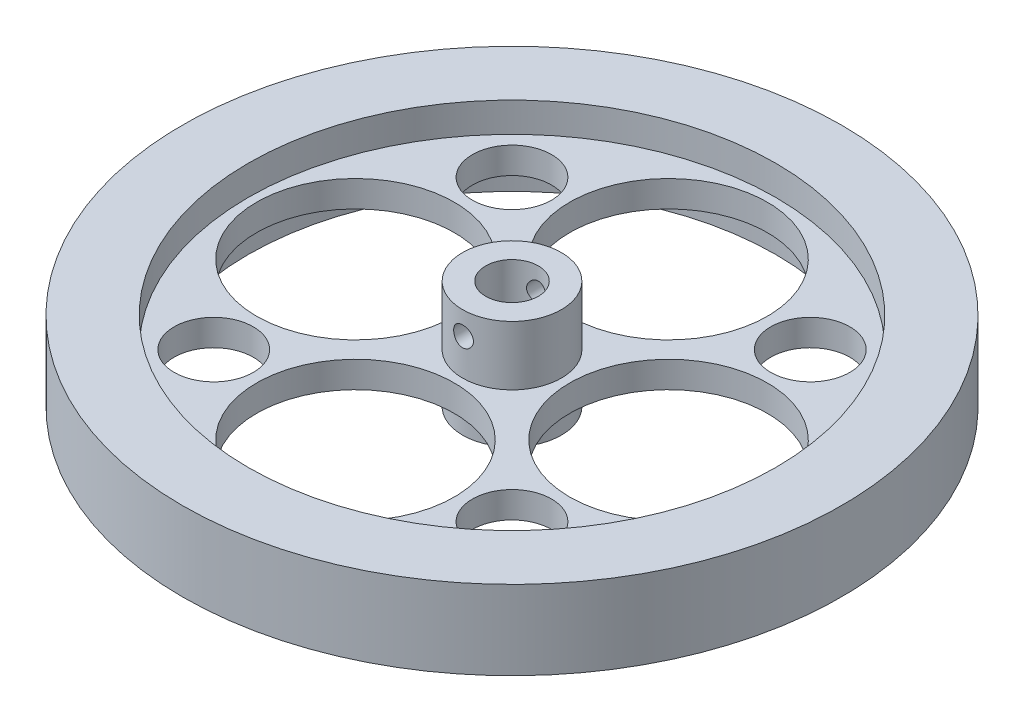
ISO-10303-21;
HEADER;
FILE_DESCRIPTION(('STEP AP214'),'2;1');
FILE_NAME('part.step','',(''),(''),'','','');
FILE_SCHEMA(('AUTOMOTIVE_DESIGN { 1 0 10303 214 1 1 1 1 }'));
ENDSEC;
DATA;
#1=APPLICATION_CONTEXT('core data for automotive mechanical design processes');
#2=APPLICATION_PROTOCOL_DEFINITION('international standard','automotive_design',2000,#1);
#3=PRODUCT_CONTEXT('',#1,'mechanical');
#4=PRODUCT('Part','Part','',(#3));
#5=PRODUCT_RELATED_PRODUCT_CATEGORY('part','',(#4));
#6=PRODUCT_DEFINITION_FORMATION('','',#4);
#7=PRODUCT_DEFINITION_CONTEXT('part definition',#1,'design');
#8=PRODUCT_DEFINITION('design','',#6,#7);
#9=PRODUCT_DEFINITION_SHAPE('','',#8);
#10=(LENGTH_UNIT() NAMED_UNIT(*) SI_UNIT(.MILLI.,.METRE.));
#11=(NAMED_UNIT(*) PLANE_ANGLE_UNIT() SI_UNIT($,.RADIAN.));
#12=(NAMED_UNIT(*) SI_UNIT($,.STERADIAN.) SOLID_ANGLE_UNIT());
#13=UNCERTAINTY_MEASURE_WITH_UNIT(LENGTH_MEASURE(1.E-05),#10,'distance_accuracy_value','');
#14=(GEOMETRIC_REPRESENTATION_CONTEXT(3) GLOBAL_UNCERTAINTY_ASSIGNED_CONTEXT((#13)) GLOBAL_UNIT_ASSIGNED_CONTEXT((#10,
#11,#12)) REPRESENTATION_CONTEXT('',''));
#15=CARTESIAN_POINT('',(0.,0.,0.));
#16=DIRECTION('',(0.,0.,1.));
#17=DIRECTION('',(1.,0.,0.));
#18=AXIS2_PLACEMENT_3D('',#15,#16,#17);
#19=CARTESIAN_POINT('',(0.,16.5,0.));
#20=DIRECTION('',(0.,-1.,0.));
#21=DIRECTION('',(0.,0.,-1.));
#22=AXIS2_PLACEMENT_3D('',#19,#20,#21);
#23=CYLINDRICAL_SURFACE('',#22,4.);
#24=CARTESIAN_POINT('',(-1.5,13.,3.70809924354783));
#25=CARTESIAN_POINT('',(-1.50000304106109,12.9189925162792,3.70809640633806));
#26=CARTESIAN_POINT('',(-1.49341597549487,12.8380050774964,3.71078260240986));
#27=CARTESIAN_POINT('',(-1.46736187895468,12.6784719170868,3.72116159304967));
#28=CARTESIAN_POINT('',(-1.44789523373263,12.599926122405,3.72885423767112));
#29=CARTESIAN_POINT('',(-1.39689657610574,12.4476246283865,3.748254802809));
#30=CARTESIAN_POINT('',(-1.36539347266348,12.3738579433489,3.7599530956926));
#31=CARTESIAN_POINT('',(-1.29131856742698,12.2326281031812,3.78603134206598));
#32=CARTESIAN_POINT('',(-1.24874344095039,12.1651668497175,3.80041210067323));
#33=CARTESIAN_POINT('',(-1.15146661374162,12.0351096883772,3.83103574665713));
#34=CARTESIAN_POINT('',(-1.09630381213306,11.9728714703706,3.84733341923603));
#35=CARTESIAN_POINT('',(-0.976395839778926,11.8582771853285,3.87949750628547));
#36=CARTESIAN_POINT('',(-0.911648630256679,11.8059232262581,3.89536382814785));
#37=CARTESIAN_POINT('',(-0.7716946551776,11.7108604877044,3.92552873936553));
#38=CARTESIAN_POINT('',(-0.696206947538027,11.6685405252841,3.93975561223505));
#39=CARTESIAN_POINT('',(-0.538555771965247,11.5973488274751,3.96438007973848));
#40=CARTESIAN_POINT('',(-0.456394630933536,11.568472428008,3.97477900217006));
#41=CARTESIAN_POINT('',(-0.291489341676832,11.5262421042254,3.9901869710344));
#42=CARTESIAN_POINT('',(-0.208923197281597,11.5122723725595,3.99540915214774));
#43=CARTESIAN_POINT('',(-0.0424643637947866,11.498278799055,4.0006401410794));
#44=CARTESIAN_POINT('',(0.0414278850628324,11.4982504223813,4.00065064414902));
#45=CARTESIAN_POINT('',(0.203743543064475,11.5117817614652,3.99559265903894));
#46=CARTESIAN_POINT('',(0.2822321782669,11.5246692979488,3.99077541996683));
#47=CARTESIAN_POINT('',(0.435839217984391,11.5625359152256,3.97693274932263));
#48=CARTESIAN_POINT('',(0.510957383430298,11.587515852262,3.96790701975578));
#49=CARTESIAN_POINT('',(0.656989017303103,11.6491704516758,3.94637769167531));
#50=CARTESIAN_POINT('',(0.727825392287308,11.6860100052684,3.93382539470077));
#51=CARTESIAN_POINT('',(0.862486607957558,11.7701920969294,3.90651310225279));
#52=CARTESIAN_POINT('',(0.926309176932322,11.8175380230176,3.8917523951284));
#53=CARTESIAN_POINT('',(1.04909048680094,11.9246272862832,3.86052529655816));
#54=CARTESIAN_POINT('',(1.10754614526348,11.9849339156504,3.84400963763883));
#55=CARTESIAN_POINT('',(1.21370395569342,12.1145929933216,3.81182460645722));
#56=CARTESIAN_POINT('',(1.261403406929,12.1839477065866,3.79615544748847));
#57=CARTESIAN_POINT('',(1.34565611808152,12.3317194674628,3.76712703500335));
#58=CARTESIAN_POINT('',(1.38193847851831,12.4103034936861,3.75382677150277));
#59=CARTESIAN_POINT('',(1.44056464441501,12.5730962251676,3.73172438629002));
#60=CARTESIAN_POINT('',(1.46291620605595,12.6573017715937,3.72291976205783));
#61=CARTESIAN_POINT('',(1.49190191709668,12.823975962316,3.71139597222848));
#62=CARTESIAN_POINT('',(1.49933521158966,12.9062841055361,3.70836785241537));
#63=CARTESIAN_POINT('',(1.50057885636272,13.0710093567417,3.70786539525016));
#64=CARTESIAN_POINT('',(1.49439261093762,13.1534264323525,3.71038967003987));
#65=CARTESIAN_POINT('',(1.46929733520157,13.3119299222877,3.72039381629735));
#66=CARTESIAN_POINT('',(1.45100618334225,13.3881311357647,3.72763276216449));
#67=CARTESIAN_POINT('',(1.40299774640638,13.5363479447202,3.74596487046362));
#68=CARTESIAN_POINT('',(1.37327812034623,13.6083626791681,3.75705882250173));
#69=CARTESIAN_POINT('',(1.30200292275278,13.7491644380762,3.7823624311608));
#70=CARTESIAN_POINT('',(1.26004545177047,13.8177292921373,3.79667328892065));
#71=CARTESIAN_POINT('',(1.16591317862479,13.947128981726,3.82662814294291));
#72=CARTESIAN_POINT('',(1.11373463696435,14.0079609746246,3.84227262594077));
#73=CARTESIAN_POINT('',(0.996727340900938,14.1241683731951,3.87433046553184));
#74=CARTESIAN_POINT('',(0.931306341491062,14.1789534087688,3.89072969357028));
#75=CARTESIAN_POINT('',(0.791797471753151,14.2768383675894,3.92149874963302));
#76=CARTESIAN_POINT('',(0.717709573322674,14.3199382529458,3.93586857107664));
#77=CARTESIAN_POINT('',(0.563016329468478,14.3929460561996,3.96094985704552));
#78=CARTESIAN_POINT('',(0.482434433064628,14.4228991237926,3.9716738133801));
#79=CARTESIAN_POINT('',(0.316881887523256,14.4686564138499,3.98829436712571));
#80=CARTESIAN_POINT('',(0.231913320723594,14.4844672854224,3.99419323299412));
#81=CARTESIAN_POINT('',(0.0653355852738171,14.5007744027548,4.00028407317073));
#82=CARTESIAN_POINT('',(-0.0161807680608437,14.502109483059,4.00078860953764));
#83=CARTESIAN_POINT('',(-0.178226786412422,14.4915848405546,3.99684889809224));
#84=CARTESIAN_POINT('',(-0.258756569245255,14.4797267091141,3.9924052471313));
#85=CARTESIAN_POINT('',(-0.414548248377124,14.4437411485064,3.97921089603771));
#86=CARTESIAN_POINT('',(-0.489890731068833,14.4199200941216,3.97056791378017));
#87=CARTESIAN_POINT('',(-0.635515473006388,14.3609899866156,3.9498778362099));
#88=CARTESIAN_POINT('',(-0.705796771275541,14.3258787966952,3.93783009655664));
#89=CARTESIAN_POINT('',(-0.842540176994411,14.2436860564952,3.91090618300074));
#90=CARTESIAN_POINT('',(-0.908717548846847,14.1961633594859,3.89593240108829));
#91=CARTESIAN_POINT('',(-1.03241734752336,14.0911921698124,3.86499507694844));
#92=CARTESIAN_POINT('',(-1.0899366712559,14.0337401341921,3.84903118274027));
#93=CARTESIAN_POINT('',(-1.19781214236196,13.9069358683549,3.81688129739175));
#94=CARTESIAN_POINT('',(-1.24762999816025,13.8371155978457,3.8007280534916));
#95=CARTESIAN_POINT('',(-1.33484709556843,13.6895841304267,3.77098325003638));
#96=CARTESIAN_POINT('',(-1.37224504878157,13.6118721159465,3.75739195631216));
#97=CARTESIAN_POINT('',(-1.4346588697426,13.4470443190246,3.73402269853266));
#98=CARTESIAN_POINT('',(-1.45906002899523,13.3596656334882,3.7244380329086));
#99=CARTESIAN_POINT('',(-1.49172356722079,13.1815147280442,3.71147994336315));
#100=CARTESIAN_POINT('',(-1.49999659339571,13.09074478729,3.70810242179736));
#101=CARTESIAN_POINT('',(-1.5,13.,3.70809924354783));
#102=B_SPLINE_CURVE_WITH_KNOTS('',3,(#24,#25,#26,#27,#28,#29,#30,#31,#32,#33,#34,#35,#36,#37,
#38,#39,#40,#41,#42,#43,#44,#45,#46,#47,#48,#49,#50,#51,#52,#53,#54,#55,#56,#57,#58,#59,#60,#61,
#62,#63,#64,#65,#66,#67,#68,#69,#70,#71,#72,#73,#74,#75,#76,#77,#78,#79,#80,#81,#82,#83,#84,#85,
#86,#87,#88,#89,#90,#91,#92,#93,#94,#95,#96,#97,#98,#99,#100,#101),.UNSPECIFIED.,.T.,.F.,(4,2,2,
2,2,2,2,2,2,2,2,2,2,2,2,2,2,2,2,2,2,2,2,2,2,2,2,2,2,2,2,2,2,2,2,2,2,2,4),(0.,0.242684541416169,
0.485361814598854,0.727459856757029,0.969630679682932,1.22274652401128,1.47591628822983,
1.73770072136421,1.9993942638133,2.24980018489679,2.50012465404857,2.73806472803194,
2.97602165263335,3.21744131210668,3.45893893628976,3.71456675065874,3.97025867827334,
4.23162592252966,4.49284751635474,4.73965657740485,4.98640395388884,5.22143845928198,
5.45652113429526,5.70041561005821,5.94439948466355,6.20385016993624,6.46330169650177,
6.72185508890168,6.98028685560126,7.22365720549935,7.46699820319479,7.7044027400389,
7.94185223512831,8.18928323676986,8.43680270894964,8.69738599542079,8.95799630544242,
9.23003178870926,9.50188762323053),.UNSPECIFIED.);
#103=CARTESIAN_POINT('',(-1.5,13.,3.70809924354783));
#104=VERTEX_POINT('',#103);
#105=EDGE_CURVE('E180',#104,#104,#102,.T.);
#106=ORIENTED_EDGE('',*,*,#105,.T.);
#107=EDGE_LOOP('',(#106));
#108=FACE_BOUND('',#107,.T.);
#109=CARTESIAN_POINT('',(0.,16.5,0.));
#110=DIRECTION('',(0.,1.,0.));
#111=DIRECTION('',(0.,0.,1.));
#112=AXIS2_PLACEMENT_3D('',#109,#110,#111);
#113=CIRCLE('',#112,4.);
#114=CARTESIAN_POINT('',(0.,16.5,4.));
#115=VERTEX_POINT('',#114);
#116=EDGE_CURVE('E250',#115,#115,#113,.T.);
#117=ORIENTED_EDGE('',*,*,#116,.T.);
#118=EDGE_LOOP('',(#117));
#119=FACE_BOUND('',#118,.T.);
#120=CARTESIAN_POINT('',(0.,0.,0.));
#121=DIRECTION('',(0.,1.,0.));
#122=DIRECTION('',(0.,0.,1.));
#123=AXIS2_PLACEMENT_3D('',#120,#121,#122);
#124=CIRCLE('',#123,4.);
#125=CARTESIAN_POINT('',(0.,0.,4.));
#126=VERTEX_POINT('',#125);
#127=EDGE_CURVE('E251',#126,#126,#124,.T.);
#128=ORIENTED_EDGE('',*,*,#127,.F.);
#129=EDGE_LOOP('',(#128));
#130=FACE_BOUND('',#129,.T.);
#131=CARTESIAN_POINT('',(0.,14.5,-4.));
#132=CARTESIAN_POINT('',(0.0812350589378528,14.5000029023031,-4.00000217456151));
#133=CARTESIAN_POINT('',(0.162450241781792,14.4933802397516,-3.99750379283184));
#134=CARTESIAN_POINT('',(0.322453452352361,14.4671718047301,-3.98778696006928));
#135=CARTESIAN_POINT('',(0.401241827987615,14.4475878995294,-3.98056918893993));
#136=CARTESIAN_POINT('',(0.554060784990879,14.3962469982282,-3.96218832391545));
#137=CARTESIAN_POINT('',(0.628100224162279,14.3645134831782,-3.9510328434944));
#138=CARTESIAN_POINT('',(0.769799310160254,14.2898935869842,-3.92588767765353));
#139=CARTESIAN_POINT('',(0.837457239177879,14.2470042144558,-3.91189723227548));
#140=CARTESIAN_POINT('',(0.967346417045825,14.1493874689291,-3.88186246971217));
#141=CARTESIAN_POINT('',(1.02927073015119,14.0942697377406,-3.86576002583566));
#142=CARTESIAN_POINT('',(1.14324421474363,13.9745895653412,-3.83360220871327));
#143=CARTESIAN_POINT('',(1.19529036359203,13.9100242439121,-3.81754685135033));
#144=CARTESIAN_POINT('',(1.28998202215985,13.7702825324768,-3.78662470617731));
#145=CARTESIAN_POINT('',(1.3321939319576,13.6947956334542,-3.77182648820818));
#146=CARTESIAN_POINT('',(1.40318646334084,13.5371516458315,-3.74599860237433));
#147=CARTESIAN_POINT('',(1.43197244961239,13.4549972368449,-3.73496742975881));
#148=CARTESIAN_POINT('',(1.47408431017549,13.2898832597418,-3.71854412824136));
#149=CARTESIAN_POINT('',(1.48799593218558,13.2070949615646,-3.71293924350838));
#150=CARTESIAN_POINT('',(1.50179556531648,13.0401838420062,-3.70738061461215));
#151=CARTESIAN_POINT('',(1.5016893680263,12.9560615861255,-3.70742453659305));
#152=CARTESIAN_POINT('',(1.48790429610018,12.794230474787,-3.71297511632055));
#153=CARTESIAN_POINT('',(1.47503808509003,12.7164390939558,-3.71815468871122));
#154=CARTESIAN_POINT('',(1.4374416786833,12.5642128495947,-3.73284938059529));
#155=CARTESIAN_POINT('',(1.41270969663258,12.4897784933861,-3.74236515298863));
#156=CARTESIAN_POINT('',(1.35163748571904,12.3447229322718,-3.76485702190253));
#157=CARTESIAN_POINT('',(1.31508648737101,12.2742005138787,-3.77789517988166));
#158=CARTESIAN_POINT('',(1.23156073762698,12.140054262409,-3.80594210139319));
#159=CARTESIAN_POINT('',(1.18458238728897,12.0764328224803,-3.82095154457158));
#160=CARTESIAN_POINT('',(1.07781780766549,11.9533963363491,-3.85248038859113));
#161=CARTESIAN_POINT('',(1.01738298716956,11.8945513592519,-3.86903347455671));
#162=CARTESIAN_POINT('',(0.887312590819022,11.7876620337942,-3.90091728164085));
#163=CARTESIAN_POINT('',(0.817675603497365,11.7396193453943,-3.91624781465952));
#164=CARTESIAN_POINT('',(0.66972343699242,11.6550696029375,-3.9442639480908));
#165=CARTESIAN_POINT('',(0.591290713844719,11.6187524187789,-3.95690498259616));
#166=CARTESIAN_POINT('',(0.428836850524583,11.56001739573,-3.97778718326962));
#167=CARTESIAN_POINT('',(0.344818210845767,11.5375933834389,-3.98603030341493));
#168=CARTESIAN_POINT('',(0.178375243148665,11.5083772124581,-3.99684443228065));
#169=CARTESIAN_POINT('',(0.0961036195622094,11.5008173936175,-3.99969369025686));
#170=CARTESIAN_POINT('',(-0.068572475255024,11.4993089361001,-4.00025893700126));
#171=CARTESIAN_POINT('',(-0.150976912983372,11.5053572796832,-3.99797606386863));
#172=CARTESIAN_POINT('',(-0.310262048561859,11.5303100423087,-3.98871709772643));
#173=CARTESIAN_POINT('',(-0.387233328007335,11.5487115437371,-3.98192470962305));
#174=CARTESIAN_POINT('',(-0.53694175495722,11.5971860725473,-3.96451477091717));
#175=CARTESIAN_POINT('',(-0.609678350347534,11.627260617948,-3.9538967228203));
#176=CARTESIAN_POINT('',(-0.751247765110155,11.6991864124395,-3.92949624407681));
#177=CARTESIAN_POINT('',(-0.819903083557796,11.7413577292234,-3.91563000209348));
#178=CARTESIAN_POINT('',(-0.949392711726626,11.8359181031716,-3.88626671564664));
#179=CARTESIAN_POINT('',(-1.01022412027045,11.8883109325452,-3.87076907009516));
#180=CARTESIAN_POINT('',(-1.12603079874454,12.0054041221243,-3.8387332949099));
#181=CARTESIAN_POINT('',(-1.18046154123569,12.0706421827727,-3.82218696503729));
#182=CARTESIAN_POINT('',(-1.27771050031903,12.2096513847077,-3.79078815746854));
#183=CARTESIAN_POINT('',(-1.32052767414518,12.2834232913885,-3.77593583194399));
#184=CARTESIAN_POINT('',(-1.39337773518998,12.4380159867723,-3.74966829822463));
#185=CARTESIAN_POINT('',(-1.42335685446918,12.5188647459104,-3.73826760328493));
#186=CARTESIAN_POINT('',(-1.46907883466889,12.6850097636878,-3.72054032891005));
#187=CARTESIAN_POINT('',(-1.48483050305535,12.7703032361981,-3.71421061057491));
#188=CARTESIAN_POINT('',(-1.50086347097839,12.9370161595411,-3.70775894792573));
#189=CARTESIAN_POINT('',(-1.50207331495837,13.0183326317169,-3.70726444523341));
#190=CARTESIAN_POINT('',(-1.49136715641593,13.1799453162762,-3.71158412745292));
#191=CARTESIAN_POINT('',(-1.47945239850124,13.2602416246716,-3.71639780898899));
#192=CARTESIAN_POINT('',(-1.44355815630242,13.4150472267166,-3.73048141585432));
#193=CARTESIAN_POINT('',(-1.41995798316524,13.4896583462453,-3.73961085376663));
#194=CARTESIAN_POINT('',(-1.3616969677992,13.6339055084944,-3.76121548297845));
#195=CARTESIAN_POINT('',(-1.32703332944945,13.7035402880701,-3.77369151995215));
#196=CARTESIAN_POINT('',(-1.24552075938154,13.8398267896976,-3.80139723903964));
#197=CARTESIAN_POINT('',(-1.1981283280301,13.9061307967999,-3.81673698440964));
#198=CARTESIAN_POINT('',(-1.09334485729906,14.0301415609712,-3.84806246757177));
#199=CARTESIAN_POINT('',(-1.03595064012808,14.0878455747868,-3.86404840943145));
#200=CARTESIAN_POINT('',(-0.909080396784623,14.1962019558218,-3.89590424609881));
#201=CARTESIAN_POINT('',(-0.839118644212993,14.2463037534347,-3.91172104900645));
#202=CARTESIAN_POINT('',(-0.691213223200821,14.3340226552766,-3.94054514457031));
#203=CARTESIAN_POINT('',(-0.613268934090621,14.3716387877364,-3.95355221851559));
#204=CARTESIAN_POINT('',(-0.447999082002311,14.4343768290483,-3.9757429260668));
#205=CARTESIAN_POINT('',(-0.360413422234207,14.4588870646019,-3.98473657158356));
#206=CARTESIAN_POINT('',(-0.181875733606381,14.4916929599207,-3.99686242179587));
#207=CARTESIAN_POINT('',(-0.0909254163648585,14.4999967514873,-3.99999756603967));
#208=CARTESIAN_POINT('',(0.,14.5,-4.));
#209=B_SPLINE_CURVE_WITH_KNOTS('',3,(#131,#132,#133,#134,#135,#136,#137,#138,#139,#140,#141,
#142,#143,#144,#145,#146,#147,#148,#149,#150,#151,#152,#153,#154,#155,#156,#157,#158,#159,#160,
#161,#162,#163,#164,#165,#166,#167,#168,#169,#170,#171,#172,#173,#174,#175,#176,#177,#178,#179,
#180,#181,#182,#183,#184,#185,#186,#187,#188,#189,#190,#191,#192,#193,#194,#195,#196,#197,#198,
#199,#200,#201,#202,#203,#204,#205,#206,#207,#208),.UNSPECIFIED.,.T.,.F.,(4,2,2,2,2,2,2,2,2,2,2,
2,2,2,2,2,2,2,2,2,2,2,2,2,2,2,2,2,2,2,2,2,2,2,2,2,2,2,4),(0.,0.243369801560559,0.48670454953046,
0.729571369213574,0.972503379609489,1.22473618582715,1.47704604925622,1.73896674501658,
2.00078269352134,2.25185874416901,2.50283106079707,2.73878345119971,2.97477138060589,
3.21522408387018,3.45575990744258,3.71246153335813,3.96920257905066,4.22991375286075,
4.49050899698846,4.73725019635925,4.9839366839052,5.2211443792384,5.45838293254453,
5.702592218596,5.94689180019868,6.20536519455658,6.46386178920141,6.72343066727204,
6.98283874956507,7.22558763480252,7.46831350211259,7.70363142426534,7.93900886656506,
8.18672471884271,8.43451941997062,8.69572329654039,8.95694749805102,9.22948515032042,
9.50188601796127),.UNSPECIFIED.);
#210=CARTESIAN_POINT('',(0.,14.5,-4.));
#211=VERTEX_POINT('',#210);
#212=EDGE_CURVE('E122',#211,#211,#209,.T.);
#213=ORIENTED_EDGE('',*,*,#212,.T.);
#214=EDGE_LOOP('',(#213));
#215=FACE_BOUND('',#214,.T.);
#216=ADVANCED_FACE('F91',(#108,#119,#130,#215),#23,.F.);
#217=CARTESIAN_POINT('',(0.,16.5,0.));
#218=DIRECTION('',(0.,-1.,0.));
#219=DIRECTION('',(0.,0.,-1.));
#220=AXIS2_PLACEMENT_3D('',#217,#218,#219);
#221=CYLINDRICAL_SURFACE('',#220,7.5);
#222=CARTESIAN_POINT('',(0.,7.5,0.));
#223=DIRECTION('',(0.,1.,0.));
#224=DIRECTION('',(0.,0.,1.));
#225=AXIS2_PLACEMENT_3D('',#222,#223,#224);
#226=CIRCLE('',#225,7.5);
#227=CARTESIAN_POINT('',(0.,7.5,7.5));
#228=VERTEX_POINT('',#227);
#229=EDGE_CURVE('E231',#228,#228,#226,.T.);
#230=ORIENTED_EDGE('',*,*,#229,.T.);
#231=EDGE_LOOP('',(#230));
#232=FACE_BOUND('',#231,.T.);
#233=CARTESIAN_POINT('',(0.,16.5,0.));
#234=DIRECTION('',(0.,1.,0.));
#235=DIRECTION('',(0.,0.,1.));
#236=AXIS2_PLACEMENT_3D('',#233,#234,#235);
#237=CIRCLE('',#236,7.5);
#238=CARTESIAN_POINT('',(0.,16.5,7.5));
#239=VERTEX_POINT('',#238);
#240=EDGE_CURVE('E245',#239,#239,#237,.T.);
#241=ORIENTED_EDGE('',*,*,#240,.F.);
#242=EDGE_LOOP('',(#241));
#243=FACE_BOUND('',#242,.T.);
#244=CARTESIAN_POINT('',(-1.5,13.,7.34846922834953));
#245=CARTESIAN_POINT('',(-1.49999691881235,12.9166534367642,7.34847088538349));
#246=CARTESIAN_POINT('',(-1.49302975757707,12.8332680650003,7.34990262402618));
#247=CARTESIAN_POINT('',(-1.46536842537441,12.668856242285,7.35546646957746));
#248=CARTESIAN_POINT('',(-1.44466327060578,12.587831733046,7.35960073717297));
#249=CARTESIAN_POINT('',(-1.39019367392958,12.4305440449688,7.37008310582665));
#250=CARTESIAN_POINT('',(-1.35644222122892,12.3542762177011,7.37642900431582));
#251=CARTESIAN_POINT('',(-1.27687366150577,12.2084877329545,7.39061699221019));
#252=CARTESIAN_POINT('',(-1.23105722790173,12.1389666991931,7.398458998102));
#253=CARTESIAN_POINT('',(-1.12796861348015,12.0076584942192,7.4148794954137));
#254=CARTESIAN_POINT('',(-1.07055848386998,11.945980618174,7.42346606755867));
#255=CARTESIAN_POINT('',(-0.946210183531966,11.8330636996315,7.440337084539));
#256=CARTESIAN_POINT('',(-0.879271345466976,11.7818253888742,7.44862150816248));
#257=CARTESIAN_POINT('',(-0.737042033886383,11.6908179735573,7.46404194626342));
#258=CARTESIAN_POINT('',(-0.661683851508316,11.651152729275,7.47116732162326));
#259=CARTESIAN_POINT('',(-0.505206225580908,11.5850875944278,7.48337605325447));
#260=CARTESIAN_POINT('',(-0.42408732213083,11.5586864621485,7.48845960066179));
#261=CARTESIAN_POINT('',(-0.259525159917742,11.5202392095706,7.49595481032628));
#262=CARTESIAN_POINT('',(-0.176126608822222,11.5080085336435,7.4984007943219));
#263=CARTESIAN_POINT('',(-0.008427852656305,11.4976735722425,7.50046381775405));
#264=CARTESIAN_POINT('',(0.0758722647477642,11.4995679255313,7.50008112979138));
#265=CARTESIAN_POINT('',(0.241713001115382,11.5172892703233,7.49655652302773));
#266=CARTESIAN_POINT('',(0.323275821447705,11.5329174657518,7.49345397548757));
#267=CARTESIAN_POINT('',(0.482597439870451,11.5773475486883,7.48488265739113));
#268=CARTESIAN_POINT('',(0.560356085620693,11.6061499632878,7.47941379216059));
#269=CARTESIAN_POINT('',(0.71042919480133,11.6762950602209,7.46665944029938));
#270=CARTESIAN_POINT('',(0.782706261200849,11.7177156266573,7.45936272262835));
#271=CARTESIAN_POINT('',(0.919357568789633,11.8118636158549,7.44375704210678));
#272=CARTESIAN_POINT('',(0.983730899287501,11.8645923396558,7.43544796282833));
#273=CARTESIAN_POINT('',(1.10392714658019,11.9809504331627,7.41856446546689));
#274=CARTESIAN_POINT('',(1.15958147486045,12.0447537800944,7.40998794686274));
#275=CARTESIAN_POINT('',(1.25942773976521,12.1808746636761,7.39367357398141));
#276=CARTESIAN_POINT('',(1.30361945959163,12.2531923613248,7.38593573556822));
#277=CARTESIAN_POINT('',(1.37934422220282,12.4045312477327,7.37217071209385));
#278=CARTESIAN_POINT('',(1.41084997166656,12.4835664514595,7.36614722345324));
#279=CARTESIAN_POINT('',(1.46008551244137,12.645956985586,7.35654714481909));
#280=CARTESIAN_POINT('',(1.47781709918496,12.7293117514286,7.35297023592642));
#281=CARTESIAN_POINT('',(1.49874900905408,12.8964472869986,7.34873218901742));
#282=CARTESIAN_POINT('',(1.50219278834687,12.9801963614655,7.34802220585731));
#283=CARTESIAN_POINT('',(1.49510644246611,13.1470723347995,7.34946728533281));
#284=CARTESIAN_POINT('',(1.48457710968366,13.2301992686783,7.35162218550582));
#285=CARTESIAN_POINT('',(1.45005331211124,13.3926529604384,7.35850848742372));
#286=CARTESIAN_POINT('',(1.42618893125895,13.4720085145536,7.36321498521745));
#287=CARTESIAN_POINT('',(1.36581155296278,13.6255949185431,7.37465234027497));
#288=CARTESIAN_POINT('',(1.32929751355977,13.6998253456536,7.38138336429404));
#289=CARTESIAN_POINT('',(1.2441062133234,13.8421196649252,7.39622108943059));
#290=CARTESIAN_POINT('',(1.19527661697413,13.9100905694512,7.40434457797355));
#291=CARTESIAN_POINT('',(1.08704335831907,14.0369624680014,7.42100585739955));
#292=CARTESIAN_POINT('',(1.02763860771681,14.0958625273739,7.42954369085727));
#293=CARTESIAN_POINT('',(0.898848410246836,14.2038438387784,7.44623018803823));
#294=CARTESIAN_POINT('',(0.829323748394445,14.252760481975,7.45437086563026));
#295=CARTESIAN_POINT('',(0.682901844952133,14.3382188222494,7.4692069144293));
#296=CARTESIAN_POINT('',(0.606004913150261,14.3747610390172,7.47590234632816));
#297=CARTESIAN_POINT('',(0.447454021236019,14.43419330762,7.487059410916));
#298=CARTESIAN_POINT('',(0.365830010217117,14.4571607773394,7.49153368713906));
#299=CARTESIAN_POINT('',(0.199784182019869,14.4890368714958,7.4977985390649));
#300=CARTESIAN_POINT('',(0.115362703066821,14.4979471892135,7.49958943799765));
#301=CARTESIAN_POINT('',(-0.0523093408554347,14.5013904714443,7.50027810681181));
#302=CARTESIAN_POINT('',(-0.135554718212253,14.4961709206843,7.49922567824026));
#303=CARTESIAN_POINT('',(-0.299956546973462,14.4720490741783,7.49445065340477));
#304=CARTESIAN_POINT('',(-0.381113024630536,14.4531469504779,7.49072809071528));
#305=CARTESIAN_POINT('',(-0.538879124617644,14.4023065118625,7.481032475475));
#306=CARTESIAN_POINT('',(-0.615498664860421,14.3703979328032,7.47506455871866));
#307=CARTESIAN_POINT('',(-0.762331830278929,14.2944816380037,7.46152083185077));
#308=CARTESIAN_POINT('',(-0.832544948651117,14.2504729661444,7.45394489468828));
#309=CARTESIAN_POINT('',(-0.965795835159535,14.1507709194069,7.43786398736791));
#310=CARTESIAN_POINT('',(-1.02869957417475,14.0949004954198,7.4293460013317));
#311=CARTESIAN_POINT('',(-1.14432392663527,13.9734246398563,7.41241834355477));
#312=CARTESIAN_POINT('',(-1.19704212480408,13.9078169057969,7.40400869794476));
#313=CARTESIAN_POINT('',(-1.29133832918279,13.7678810249497,7.3881501412478));
#314=CARTESIAN_POINT('',(-1.33279022195961,13.6934665582593,7.38071255446371));
#315=CARTESIAN_POINT('',(-1.40253607393175,13.5386008400506,7.36777855777287));
#316=CARTESIAN_POINT('',(-1.43084196896908,13.4581551419537,7.36228038807748));
#317=CARTESIAN_POINT('',(-1.4680037097813,13.3146063168448,7.3549452169166));
#318=CARTESIAN_POINT('',(-1.47998084778413,13.2523218707315,7.35253177367824));
#319=CARTESIAN_POINT('',(-1.49598002694097,13.1266990681708,7.34929317692711));
#320=CARTESIAN_POINT('',(-1.50000234234439,13.0633607481326,7.34846796865859));
#321=CARTESIAN_POINT('',(-1.5,13.,7.34846922834953));
#322=B_SPLINE_CURVE_WITH_KNOTS('',3,(#244,#245,#246,#247,#248,#249,#250,#251,#252,#253,#254,
#255,#256,#257,#258,#259,#260,#261,#262,#263,#264,#265,#266,#267,#268,#269,#270,#271,#272,#273,
#274,#275,#276,#277,#278,#279,#280,#281,#282,#283,#284,#285,#286,#287,#288,#289,#290,#291,#292,
#293,#294,#295,#296,#297,#298,#299,#300,#301,#302,#303,#304,#305,#306,#307,#308,#309,#310,#311,
#312,#313,#314,#315,#316,#317,#318,#319,#320,#321),.UNSPECIFIED.,.T.,.F.,(4,2,2,2,2,2,2,2,2,2,2,
2,2,2,2,2,2,2,2,2,2,2,2,2,2,2,2,2,2,2,2,2,2,2,2,2,2,2,4),(0.,0.249807695804143,
0.499815358926445,0.74957474691088,0.999320197289796,1.25223378822655,1.50516510053133,
1.76030100656175,2.0154130236984,2.26716373324621,2.51889018174372,2.76703184450306,
3.01518343610625,3.26489886333455,3.51464303655099,3.76874020143725,4.02284217184081,
4.27748794759165,4.53210052524037,4.7823563670689,5.03259801792632,5.28044012674978,
5.52830265531597,5.77939589661782,6.03051499305313,6.28548902600176,6.54045234945157,
6.79394720367975,7.04741152037442,7.29646526122029,7.54551587050135,7.79400025613177,
8.04250428202026,8.29501728038395,8.54759008334671,8.80288347868561,9.05794462633399,
9.24785705455344,9.43776293526322),.UNSPECIFIED.);
#323=CARTESIAN_POINT('',(-1.5,13.,7.34846922834953));
#324=VERTEX_POINT('',#323);
#325=EDGE_CURVE('E157',#324,#324,#322,.T.);
#326=ORIENTED_EDGE('',*,*,#325,.F.);
#327=EDGE_LOOP('',(#326));
#328=FACE_BOUND('',#327,.T.);
#329=CARTESIAN_POINT('',(0.,14.5,-7.5));
#330=CARTESIAN_POINT('',(0.0833653601889497,14.4999969332525,-7.49999846371307));
#331=CARTESIAN_POINT('',(0.166769490302283,14.4930267355485,-7.49859577767346));
#332=CARTESIAN_POINT('',(0.331220261533529,14.4653522498271,-7.49313548434847));
#333=CARTESIAN_POINT('',(0.412264976312033,14.4446370507977,-7.48907576790279));
#334=CARTESIAN_POINT('',(0.569595457894969,14.3901380895688,-7.4787547391743));
#335=CARTESIAN_POINT('',(0.645885701899701,14.356366844733,-7.47249553615077));
#336=CARTESIAN_POINT('',(0.791711983296338,14.2767516287331,-7.45845597052971));
#337=CARTESIAN_POINT('',(0.861248422613717,14.2309083765892,-7.4506756985356));
#338=CARTESIAN_POINT('',(0.992540215972297,14.1277922585629,-7.43433247994955));
#339=CARTESIAN_POINT('',(1.05419092673779,14.0703874669132,-7.42576118256521));
#340=CARTESIAN_POINT('',(1.16705513491204,13.9460613754124,-7.40886270678882));
#341=CARTESIAN_POINT('',(1.21826781715564,13.8791393329973,-7.40053554750636));
#342=CARTESIAN_POINT('',(1.30924763002143,13.7369257104822,-7.38498662718923));
#343=CARTESIAN_POINT('',(1.3489064082988,13.6615635343055,-7.37777561047419));
#344=CARTESIAN_POINT('',(1.41495849987046,13.5050772714939,-7.36539402087627));
#345=CARTESIAN_POINT('',(1.44135312365586,13.4239537549805,-7.36022324642942));
#346=CARTESIAN_POINT('',(1.47978794982724,13.2593734541381,-7.35259207878307));
#347=CARTESIAN_POINT('',(1.49201174693817,13.1759611837867,-7.35009705160781));
#348=CARTESIAN_POINT('',(1.50232819158918,13.0082352679535,-7.34799562590941));
#349=CARTESIAN_POINT('',(1.50042228407025,12.9239217155198,-7.34838893201761));
#350=CARTESIAN_POINT('',(1.48268185965273,12.7581298179685,-7.35198826722277));
#351=CARTESIAN_POINT('',(1.46705781036586,12.676627891559,-7.35515179288145));
#352=CARTESIAN_POINT('',(1.42265682693458,12.5174258850055,-7.36386819240002));
#353=CARTESIAN_POINT('',(1.39387926465102,12.4397259866215,-7.36942118036668));
#354=CARTESIAN_POINT('',(1.32378717551208,12.2897271074446,-7.38233427750612));
#355=CARTESIAN_POINT('',(1.28238922684817,12.2174681806462,-7.38970634720557));
#356=CARTESIAN_POINT('',(1.18829036185902,12.0808437250408,-7.40541928159593));
#357=CARTESIAN_POINT('',(1.13558814653524,12.0164791047233,-7.41376025757549));
#358=CARTESIAN_POINT('',(1.01924990184088,11.8962558963146,-7.43065531862193));
#359=CARTESIAN_POINT('',(0.955434241818668,11.8405711482113,-7.43921053816357));
#360=CARTESIAN_POINT('',(0.819277536093016,11.7406692305482,-7.45543273071613));
#361=CARTESIAN_POINT('',(0.746936381069084,11.6964522080596,-7.4630996923346));
#362=CARTESIAN_POINT('',(0.595589080318382,11.620708736161,-7.47670035241331));
#363=CARTESIAN_POINT('',(0.51657272937795,11.5892021595332,-7.48263133272408));
#364=CARTESIAN_POINT('',(0.354223464672997,11.5399592889421,-7.49207113481787));
#365=CARTESIAN_POINT('',(0.270891075108675,11.5222213268896,-7.49558025000797));
#366=CARTESIAN_POINT('',(0.103769108440726,11.5012653193086,-7.49974007800302));
#367=CARTESIAN_POINT('',(0.0200104924883651,11.4978093706896,-7.50043761978705));
#368=CARTESIAN_POINT('',(-0.14688740128907,11.5048747884133,-7.49902577895154));
#369=CARTESIAN_POINT('',(-0.230026713665689,11.5153953690289,-7.49691655412169));
#370=CARTESIAN_POINT('',(-0.392558489919811,11.5499175603159,-7.49015748012026));
#371=CARTESIAN_POINT('',(-0.471977922509854,11.5737971027469,-7.4855306460631));
#372=CARTESIAN_POINT('',(-0.6256854412495,11.6342259739837,-7.47425328091549));
#373=CARTESIAN_POINT('',(-0.699973142456309,11.6707762520152,-7.4676025982134));
#374=CARTESIAN_POINT('',(-0.842311760529325,11.756023735977,-7.45289867299942));
#375=CARTESIAN_POINT('',(-0.910275190128281,11.8048641715584,-7.44482925655578));
#376=CARTESIAN_POINT('',(-1.03712702867881,11.9131137868109,-7.42822102244824));
#377=CARTESIAN_POINT('',(-1.09601446339614,11.9725240995998,-7.41968215452582));
#378=CARTESIAN_POINT('',(-1.20396088616126,12.1013100278367,-7.40293955335447));
#379=CARTESIAN_POINT('',(-1.25285655367298,12.170823616332,-7.39474290349956));
#380=CARTESIAN_POINT('',(-1.33827813007681,12.317217042035,-7.37976287694291));
#381=CARTESIAN_POINT('',(-1.37480453388435,12.3940965843603,-7.37297944370014));
#382=CARTESIAN_POINT('',(-1.43422776237294,12.5526523692243,-7.36165110876574));
#383=CARTESIAN_POINT('',(-1.45719524968658,12.6343012618155,-7.3570946230828));
#384=CARTESIAN_POINT('',(-1.48906297744079,12.8004001802364,-7.35071155188038));
#385=CARTESIAN_POINT('',(-1.49796505233767,12.884849839314,-7.34888461036667));
#386=CARTESIAN_POINT('',(-1.5013813663012,13.0525132968165,-7.34818724447069));
#387=CARTESIAN_POINT('',(-1.49615368210634,13.1357217233905,-7.34926378783951));
#388=CARTESIAN_POINT('',(-1.47202845615009,13.3000474748575,-7.35413360226921));
#389=CARTESIAN_POINT('',(-1.45313102419395,13.3811648165422,-7.35792685150754));
#390=CARTESIAN_POINT('',(-1.40231785274843,13.5388415668608,-7.36777896328738));
#391=CARTESIAN_POINT('',(-1.37043376007602,13.6154115407536,-7.37383231528246));
#392=CARTESIAN_POINT('',(-1.29458196690241,13.7621555811017,-7.38752572461255));
#393=CARTESIAN_POINT('',(-1.25061325316232,13.8323291105877,-7.39516591498341));
#394=CARTESIAN_POINT('',(-1.15095887217962,13.9655733582255,-7.41133440784838));
#395=CARTESIAN_POINT('',(-1.09508683085277,14.0285031479014,-7.41987559364549));
#396=CARTESIAN_POINT('',(-0.973596553519712,14.1441793082938,-7.43679122807932));
#397=CARTESIAN_POINT('',(-0.907976080730004,14.1969233354759,-7.44516563794777));
#398=CARTESIAN_POINT('',(-0.768026443632371,14.2912519659197,-7.46090748581957));
#399=CARTESIAN_POINT('',(-0.693613326644753,14.33271400492,-7.46826346828869));
#400=CARTESIAN_POINT('',(-0.5387495414111,14.4024791838949,-7.481026876275));
#401=CARTESIAN_POINT('',(-0.458304391294691,14.4307941842987,-7.48643605707924));
#402=CARTESIAN_POINT('',(-0.31473223338567,14.4679779220671,-7.49364558893056));
#403=CARTESIAN_POINT('',(-0.252422496020677,14.4799647905616,-7.49601454737677));
#404=CARTESIAN_POINT('',(-0.1267492878151,14.4959768685375,-7.49919231209839));
#405=CARTESIAN_POINT('',(-0.0633858506229285,14.5000023317647,-7.50000116809732));
#406=CARTESIAN_POINT('',(0.,14.5,-7.5));
#407=B_SPLINE_CURVE_WITH_KNOTS('',3,(#329,#330,#331,#332,#333,#334,#335,#336,#337,#338,#339,
#340,#341,#342,#343,#344,#345,#346,#347,#348,#349,#350,#351,#352,#353,#354,#355,#356,#357,#358,
#359,#360,#361,#362,#363,#364,#365,#366,#367,#368,#369,#370,#371,#372,#373,#374,#375,#376,#377,
#378,#379,#380,#381,#382,#383,#384,#385,#386,#387,#388,#389,#390,#391,#392,#393,#394,#395,#396,
#397,#398,#399,#400,#401,#402,#403,#404,#405,#406),.UNSPECIFIED.,.T.,.F.,(4,2,2,2,2,2,2,2,2,2,2,
2,2,2,2,2,2,2,2,2,2,2,2,2,2,2,2,2,2,2,2,2,2,2,2,2,2,2,4),(0.,0.249864195991888,
0.499926976036984,0.749750602875512,0.999559353346295,1.25239900516828,1.50525839512105,
1.76041792508884,2.01555224047796,2.26734277655381,2.51910756421838,2.76707590509417,
3.01505608880594,3.26471235305389,3.51439732124505,3.76857378737026,4.0227535130973,
4.27732912281036,4.53187388547054,4.78216103514398,5.03243411486801,5.28045680926085,
5.52849808824033,5.77957599050038,6.03068082518895,6.28560942868839,6.540527830852,
6.79410571549085,7.04765052495622,7.29659583851552,7.54553915238912,7.79387941879665,
8.042240513728,8.29482114358714,8.54745981799396,8.80274245013455,9.05779433276278,
9.24778162934841,9.43776287056494),.UNSPECIFIED.);
#408=CARTESIAN_POINT('',(0.,14.5,-7.5));
#409=VERTEX_POINT('',#408);
#410=EDGE_CURVE('E95',#409,#409,#407,.T.);
#411=ORIENTED_EDGE('',*,*,#410,.F.);
#412=EDGE_LOOP('',(#411));
#413=FACE_BOUND('',#412,.T.);
#414=ADVANCED_FACE('F163',(#232,#243,#328,#413),#221,.T.);
#415=CARTESIAN_POINT('',(0.,12.,0.));
#416=DIRECTION('',(0.,-1.,0.));
#417=DIRECTION('',(0.,0.,-1.));
#418=AXIS2_PLACEMENT_3D('',#415,#416,#417);
#419=CYLINDRICAL_SURFACE('',#418,40.);
#420=CARTESIAN_POINT('',(0.,0.,0.));
#421=DIRECTION('',(0.,1.,0.));
#422=DIRECTION('',(0.,0.,1.));
#423=AXIS2_PLACEMENT_3D('',#420,#421,#422);
#424=CIRCLE('',#423,40.);
#425=CARTESIAN_POINT('',(0.,0.,40.));
#426=VERTEX_POINT('',#425);
#427=EDGE_CURVE('E225',#426,#426,#424,.T.);
#428=ORIENTED_EDGE('',*,*,#427,.F.);
#429=EDGE_LOOP('',(#428));
#430=FACE_BOUND('',#429,.T.);
#431=CARTESIAN_POINT('',(0.,3.5,0.));
#432=DIRECTION('',(0.,1.,0.));
#433=DIRECTION('',(0.,0.,1.));
#434=AXIS2_PLACEMENT_3D('',#431,#432,#433);
#435=CIRCLE('',#434,40.);
#436=CARTESIAN_POINT('',(0.,3.5,40.));
#437=VERTEX_POINT('',#436);
#438=EDGE_CURVE('E235',#437,#437,#435,.T.);
#439=ORIENTED_EDGE('',*,*,#438,.T.);
#440=EDGE_LOOP('',(#439));
#441=FACE_BOUND('',#440,.T.);
#442=ADVANCED_FACE('F217',(#430,#441),#419,.F.);
#443=CARTESIAN_POINT('',(0.,7.5,0.));
#444=DIRECTION('',(0.,1.,0.));
#445=DIRECTION('',(0.,0.,1.));
#446=AXIS2_PLACEMENT_3D('',#443,#444,#445);
#447=CIRCLE('',#446,40.);
#448=CARTESIAN_POINT('',(0.,7.5,40.));
#449=VERTEX_POINT('',#448);
#450=EDGE_CURVE('E11',#449,#449,#447,.T.);
#451=ORIENTED_EDGE('',*,*,#450,.F.);
#452=EDGE_LOOP('',(#451));
#453=FACE_BOUND('',#452,.T.);
#454=CARTESIAN_POINT('',(0.,12.,0.));
#455=DIRECTION('',(0.,1.,0.));
#456=DIRECTION('',(0.,0.,1.));
#457=AXIS2_PLACEMENT_3D('',#454,#455,#456);
#458=CIRCLE('',#457,40.);
#459=CARTESIAN_POINT('',(0.,12.,40.));
#460=VERTEX_POINT('',#459);
#461=EDGE_CURVE('E111',#460,#460,#458,.T.);
#462=ORIENTED_EDGE('',*,*,#461,.T.);
#463=EDGE_LOOP('',(#462));
#464=FACE_BOUND('',#463,.T.);
#465=ADVANCED_FACE('F93',(#453,#464),#419,.F.);
#466=CARTESIAN_POINT('',(0.,12.,0.));
#467=DIRECTION('',(0.,-1.,0.));
#468=DIRECTION('',(0.,0.,-1.));
#469=AXIS2_PLACEMENT_3D('',#466,#467,#468);
#470=CYLINDRICAL_SURFACE('',#469,50.);
#471=CARTESIAN_POINT('',(0.,12.,0.));
#472=DIRECTION('',(0.,1.,0.));
#473=DIRECTION('',(0.,0.,1.));
#474=AXIS2_PLACEMENT_3D('',#471,#472,#473);
#475=CIRCLE('',#474,50.);
#476=CARTESIAN_POINT('',(0.,12.,50.));
#477=VERTEX_POINT('',#476);
#478=EDGE_CURVE('E105',#477,#477,#475,.T.);
#479=ORIENTED_EDGE('',*,*,#478,.F.);
#480=EDGE_LOOP('',(#479));
#481=FACE_BOUND('',#480,.T.);
#482=CARTESIAN_POINT('',(0.,0.,0.));
#483=DIRECTION('',(0.,1.,0.));
#484=DIRECTION('',(0.,0.,1.));
#485=AXIS2_PLACEMENT_3D('',#482,#483,#484);
#486=CIRCLE('',#485,50.);
#487=CARTESIAN_POINT('',(0.,0.,50.));
#488=VERTEX_POINT('',#487);
#489=EDGE_CURVE('E115',#488,#488,#486,.T.);
#490=ORIENTED_EDGE('',*,*,#489,.T.);
#491=EDGE_LOOP('',(#490));
#492=FACE_BOUND('',#491,.T.);
#493=ADVANCED_FACE('F208',(#481,#492),#470,.T.);
#494=CARTESIAN_POINT('',(0.,12.,0.));
#495=DIRECTION('',(0.,1.,0.));
#496=DIRECTION('',(0.,0.,1.));
#497=AXIS2_PLACEMENT_3D('',#494,#495,#496);
#498=PLANE('',#497);
#499=ORIENTED_EDGE('',*,*,#461,.F.);
#500=EDGE_LOOP('',(#499));
#501=FACE_BOUND('',#500,.T.);
#502=ORIENTED_EDGE('',*,*,#478,.T.);
#503=EDGE_LOOP('',(#502));
#504=FACE_BOUND('',#503,.T.);
#505=ADVANCED_FACE('F205',(#501,#504),#498,.T.);
#506=CARTESIAN_POINT('',(0.,0.,0.));
#507=DIRECTION('',(0.,1.,0.));
#508=DIRECTION('',(0.,0.,1.));
#509=AXIS2_PLACEMENT_3D('',#506,#507,#508);
#510=PLANE('',#509);
#511=ORIENTED_EDGE('',*,*,#427,.T.);
#512=EDGE_LOOP('',(#511));
#513=FACE_BOUND('',#512,.T.);
#514=ORIENTED_EDGE('',*,*,#489,.F.);
#515=EDGE_LOOP('',(#514));
#516=FACE_BOUND('',#515,.T.);
#517=ADVANCED_FACE('F199',(#513,#516),#510,.F.);
#518=CARTESIAN_POINT('',(0.,7.5,0.));
#519=DIRECTION('',(0.,1.,0.));
#520=DIRECTION('',(0.,0.,1.));
#521=AXIS2_PLACEMENT_3D('',#518,#519,#520);
#522=PLANE('',#521);
#523=CARTESIAN_POINT('',(1.34130558950027E-12,7.5,23.75));
#524=DIRECTION('',(0.,1.,0.));
#525=DIRECTION('',(0.,0.,1.));
#526=AXIS2_PLACEMENT_3D('',#523,#524,#525);
#527=CIRCLE('',#526,15.0000000000014);
#528=CARTESIAN_POINT('',(1.34130558950027E-12,7.5,38.7500000000014));
#529=VERTEX_POINT('',#528);
#530=EDGE_CURVE('E156',#529,#529,#527,.T.);
#531=ORIENTED_EDGE('',*,*,#530,.F.);
#532=EDGE_LOOP('',(#531));
#533=FACE_BOUND('',#532,.T.);
#534=CARTESIAN_POINT('',(-22.6274169979682,7.5,22.6274169979695));
#535=DIRECTION('',(0.,1.,0.));
#536=DIRECTION('',(0.,0.,1.));
#537=AXIS2_PLACEMENT_3D('',#534,#535,#536);
#538=CIRCLE('',#537,6.00000000000064);
#539=CARTESIAN_POINT('',(-22.6274169979682,7.5,28.6274169979702));
#540=VERTEX_POINT('',#539);
#541=EDGE_CURVE('E152',#540,#540,#538,.T.);
#542=ORIENTED_EDGE('',*,*,#541,.F.);
#543=EDGE_LOOP('',(#542));
#544=FACE_BOUND('',#543,.T.);
#545=CARTESIAN_POINT('',(-22.6274169979696,7.5,-22.6274169979695));
#546=DIRECTION('',(0.,1.,0.));
#547=DIRECTION('',(0.,0.,1.));
#548=AXIS2_PLACEMENT_3D('',#545,#546,#547);
#549=CIRCLE('',#548,6.);
#550=CARTESIAN_POINT('',(-22.6274169979696,7.5,-16.6274169979695));
#551=VERTEX_POINT('',#550);
#552=EDGE_CURVE('E147',#551,#551,#549,.T.);
#553=ORIENTED_EDGE('',*,*,#552,.F.);
#554=EDGE_LOOP('',(#553));
#555=FACE_BOUND('',#554,.T.);
#556=CARTESIAN_POINT('',(0.,7.5,-23.75));
#557=DIRECTION('',(0.,1.,0.));
#558=DIRECTION('',(0.,0.,1.));
#559=AXIS2_PLACEMENT_3D('',#556,#557,#558);
#560=CIRCLE('',#559,15.);
#561=CARTESIAN_POINT('',(0.,7.5,-8.75));
#562=VERTEX_POINT('',#561);
#563=EDGE_CURVE('E142',#562,#562,#560,.T.);
#564=ORIENTED_EDGE('',*,*,#563,.F.);
#565=EDGE_LOOP('',(#564));
#566=FACE_BOUND('',#565,.T.);
#567=CARTESIAN_POINT('',(23.7500000000007,7.5,-6.70652794750133E-13));
#568=DIRECTION('',(0.,1.,0.));
#569=DIRECTION('',(0.,0.,1.));
#570=AXIS2_PLACEMENT_3D('',#567,#568,#569);
#571=CIRCLE('',#570,15.0000000000005);
#572=CARTESIAN_POINT('',(23.7500000000007,7.5,14.9999999999999));
#573=VERTEX_POINT('',#572);
#574=EDGE_CURVE('E137',#573,#573,#571,.T.);
#575=ORIENTED_EDGE('',*,*,#574,.F.);
#576=EDGE_LOOP('',(#575));
#577=FACE_BOUND('',#576,.T.);
#578=CARTESIAN_POINT('',(22.6274169979708,7.5,22.6274169979682));
#579=DIRECTION('',(0.,1.,0.));
#580=DIRECTION('',(0.,0.,1.));
#581=AXIS2_PLACEMENT_3D('',#578,#579,#580);
#582=CIRCLE('',#581,6.00000000000176);
#583=CARTESIAN_POINT('',(22.6274169979708,7.5,28.62741699797));
#584=VERTEX_POINT('',#583);
#585=EDGE_CURVE('E132',#584,#584,#582,.T.);
#586=ORIENTED_EDGE('',*,*,#585,.F.);
#587=EDGE_LOOP('',(#586));
#588=FACE_BOUND('',#587,.T.);
#589=CARTESIAN_POINT('',(22.6274169979695,7.5,-22.6274169979708));
#590=DIRECTION('',(0.,1.,0.));
#591=DIRECTION('',(0.,0.,1.));
#592=AXIS2_PLACEMENT_3D('',#589,#590,#591);
#593=CIRCLE('',#592,6.00000000000128);
#594=CARTESIAN_POINT('',(22.6274169979695,7.5,-16.6274169979695));
#595=VERTEX_POINT('',#594);
#596=EDGE_CURVE('E127',#595,#595,#593,.T.);
#597=ORIENTED_EDGE('',*,*,#596,.F.);
#598=EDGE_LOOP('',(#597));
#599=FACE_BOUND('',#598,.T.);
#600=CARTESIAN_POINT('',(-23.7499999999993,7.5,6.73561330898108E-13));
#601=DIRECTION('',(0.,1.,0.));
#602=DIRECTION('',(0.,0.,1.));
#603=AXIS2_PLACEMENT_3D('',#600,#601,#602);
#604=CIRCLE('',#603,15.0000000000011);
#605=CARTESIAN_POINT('',(-23.7499999999993,7.5,15.0000000000018));
#606=VERTEX_POINT('',#605);
#607=EDGE_CURVE('E121',#606,#606,#604,.T.);
#608=ORIENTED_EDGE('',*,*,#607,.F.);
#609=EDGE_LOOP('',(#608));
#610=FACE_BOUND('',#609,.T.);
#611=ORIENTED_EDGE('',*,*,#229,.F.);
#612=EDGE_LOOP('',(#611));
#613=FACE_BOUND('',#612,.T.);
#614=ORIENTED_EDGE('',*,*,#450,.T.);
#615=EDGE_LOOP('',(#614));
#616=FACE_BOUND('',#615,.T.);
#617=ADVANCED_FACE('F194',(#533,#544,#555,#566,#577,#588,#599,#610,#613,#616),#522,.T.);
#618=CARTESIAN_POINT('',(0.,3.5,0.));
#619=DIRECTION('',(0.,1.,0.));
#620=DIRECTION('',(0.,0.,1.));
#621=AXIS2_PLACEMENT_3D('',#618,#619,#620);
#622=PLANE('',#621);
#623=CARTESIAN_POINT('',(1.34130558950027E-12,3.5,23.75));
#624=DIRECTION('',(0.,1.,0.));
#625=DIRECTION('',(0.,0.,1.));
#626=AXIS2_PLACEMENT_3D('',#623,#624,#625);
#627=CIRCLE('',#626,15.0000000000014);
#628=CARTESIAN_POINT('',(1.34130558950027E-12,3.5,38.7500000000014));
#629=VERTEX_POINT('',#628);
#630=EDGE_CURVE('E153',#629,#629,#627,.T.);
#631=ORIENTED_EDGE('',*,*,#630,.T.);
#632=EDGE_LOOP('',(#631));
#633=FACE_BOUND('',#632,.T.);
#634=CARTESIAN_POINT('',(-22.6274169979682,3.5,22.6274169979695));
#635=DIRECTION('',(0.,1.,0.));
#636=DIRECTION('',(0.,0.,1.));
#637=AXIS2_PLACEMENT_3D('',#634,#635,#636);
#638=CIRCLE('',#637,6.00000000000064);
#639=CARTESIAN_POINT('',(-22.6274169979682,3.5,28.6274169979702));
#640=VERTEX_POINT('',#639);
#641=EDGE_CURVE('E148',#640,#640,#638,.T.);
#642=ORIENTED_EDGE('',*,*,#641,.T.);
#643=EDGE_LOOP('',(#642));
#644=FACE_BOUND('',#643,.T.);
#645=CARTESIAN_POINT('',(-22.6274169979696,3.5,-22.6274169979695));
#646=DIRECTION('',(0.,1.,0.));
#647=DIRECTION('',(0.,0.,1.));
#648=AXIS2_PLACEMENT_3D('',#645,#646,#647);
#649=CIRCLE('',#648,6.);
#650=CARTESIAN_POINT('',(-22.6274169979696,3.5,-16.6274169979695));
#651=VERTEX_POINT('',#650);
#652=EDGE_CURVE('E143',#651,#651,#649,.T.);
#653=ORIENTED_EDGE('',*,*,#652,.T.);
#654=EDGE_LOOP('',(#653));
#655=FACE_BOUND('',#654,.T.);
#656=CARTESIAN_POINT('',(0.,3.5,-23.75));
#657=DIRECTION('',(0.,1.,0.));
#658=DIRECTION('',(0.,0.,1.));
#659=AXIS2_PLACEMENT_3D('',#656,#657,#658);
#660=CIRCLE('',#659,15.);
#661=CARTESIAN_POINT('',(0.,3.5,-8.75));
#662=VERTEX_POINT('',#661);
#663=EDGE_CURVE('E138',#662,#662,#660,.T.);
#664=ORIENTED_EDGE('',*,*,#663,.T.);
#665=EDGE_LOOP('',(#664));
#666=FACE_BOUND('',#665,.T.);
#667=CARTESIAN_POINT('',(23.7500000000007,3.5,-6.70652794750133E-13));
#668=DIRECTION('',(0.,1.,0.));
#669=DIRECTION('',(0.,0.,1.));
#670=AXIS2_PLACEMENT_3D('',#667,#668,#669);
#671=CIRCLE('',#670,15.0000000000005);
#672=CARTESIAN_POINT('',(23.7500000000007,3.5,14.9999999999999));
#673=VERTEX_POINT('',#672);
#674=EDGE_CURVE('E133',#673,#673,#671,.T.);
#675=ORIENTED_EDGE('',*,*,#674,.T.);
#676=EDGE_LOOP('',(#675));
#677=FACE_BOUND('',#676,.T.);
#678=CARTESIAN_POINT('',(22.6274169979708,3.5,22.6274169979682));
#679=DIRECTION('',(0.,1.,0.));
#680=DIRECTION('',(0.,0.,1.));
#681=AXIS2_PLACEMENT_3D('',#678,#679,#680);
#682=CIRCLE('',#681,6.00000000000176);
#683=CARTESIAN_POINT('',(22.6274169979708,3.5,28.62741699797));
#684=VERTEX_POINT('',#683);
#685=EDGE_CURVE('E128',#684,#684,#682,.T.);
#686=ORIENTED_EDGE('',*,*,#685,.T.);
#687=EDGE_LOOP('',(#686));
#688=FACE_BOUND('',#687,.T.);
#689=CARTESIAN_POINT('',(22.6274169979695,3.5,-22.6274169979708));
#690=DIRECTION('',(0.,1.,0.));
#691=DIRECTION('',(0.,0.,1.));
#692=AXIS2_PLACEMENT_3D('',#689,#690,#691);
#693=CIRCLE('',#692,6.00000000000128);
#694=CARTESIAN_POINT('',(22.6274169979695,3.5,-16.6274169979695));
#695=VERTEX_POINT('',#694);
#696=EDGE_CURVE('E123',#695,#695,#693,.T.);
#697=ORIENTED_EDGE('',*,*,#696,.T.);
#698=EDGE_LOOP('',(#697));
#699=FACE_BOUND('',#698,.T.);
#700=CARTESIAN_POINT('',(-23.7499999999993,3.5,6.73561330898108E-13));
#701=DIRECTION('',(0.,1.,0.));
#702=DIRECTION('',(0.,0.,1.));
#703=AXIS2_PLACEMENT_3D('',#700,#701,#702);
#704=CIRCLE('',#703,15.0000000000011);
#705=CARTESIAN_POINT('',(-23.7499999999993,3.5,15.0000000000018));
#706=VERTEX_POINT('',#705);
#707=EDGE_CURVE('E117',#706,#706,#704,.T.);
#708=ORIENTED_EDGE('',*,*,#707,.T.);
#709=EDGE_LOOP('',(#708));
#710=FACE_BOUND('',#709,.T.);
#711=CARTESIAN_POINT('',(0.,3.5,0.));
#712=DIRECTION('',(0.,1.,0.));
#713=DIRECTION('',(0.,0.,1.));
#714=AXIS2_PLACEMENT_3D('',#711,#712,#713);
#715=CIRCLE('',#714,7.5);
#716=CARTESIAN_POINT('',(0.,3.5,7.5));
#717=VERTEX_POINT('',#716);
#718=EDGE_CURVE('E240',#717,#717,#715,.F.);
#719=ORIENTED_EDGE('',*,*,#718,.F.);
#720=EDGE_LOOP('',(#719));
#721=FACE_BOUND('',#720,.T.);
#722=ORIENTED_EDGE('',*,*,#438,.F.);
#723=EDGE_LOOP('',(#722));
#724=FACE_BOUND('',#723,.T.);
#725=ADVANCED_FACE('F198',(#633,#644,#655,#666,#677,#688,#699,#710,#721,#724),#622,.F.);
#726=CARTESIAN_POINT('',(0.,0.,0.));
#727=DIRECTION('',(0.,1.,0.));
#728=DIRECTION('',(0.,0.,1.));
#729=AXIS2_PLACEMENT_3D('',#726,#727,#728);
#730=CIRCLE('',#729,7.5);
#731=CARTESIAN_POINT('',(0.,0.,7.5));
#732=VERTEX_POINT('',#731);
#733=EDGE_CURVE('E246',#732,#732,#730,.T.);
#734=ORIENTED_EDGE('',*,*,#733,.T.);
#735=EDGE_LOOP('',(#734));
#736=FACE_BOUND('',#735,.T.);
#737=ORIENTED_EDGE('',*,*,#718,.T.);
#738=EDGE_LOOP('',(#737));
#739=FACE_BOUND('',#738,.T.);
#740=ADVANCED_FACE('F203',(#736,#739),#221,.T.);
#741=CARTESIAN_POINT('',(0.,16.5,0.));
#742=DIRECTION('',(0.,1.,0.));
#743=DIRECTION('',(0.,0.,1.));
#744=AXIS2_PLACEMENT_3D('',#741,#742,#743);
#745=PLANE('',#744);
#746=ORIENTED_EDGE('',*,*,#116,.F.);
#747=EDGE_LOOP('',(#746));
#748=FACE_BOUND('',#747,.T.);
#749=ORIENTED_EDGE('',*,*,#240,.T.);
#750=EDGE_LOOP('',(#749));
#751=FACE_BOUND('',#750,.T.);
#752=ADVANCED_FACE('F324',(#748,#751),#745,.T.);
#753=CARTESIAN_POINT('',(0.,0.,0.));
#754=DIRECTION('',(0.,1.,0.));
#755=DIRECTION('',(0.,0.,1.));
#756=AXIS2_PLACEMENT_3D('',#753,#754,#755);
#757=PLANE('',#756);
#758=ORIENTED_EDGE('',*,*,#127,.T.);
#759=EDGE_LOOP('',(#758));
#760=FACE_BOUND('',#759,.T.);
#761=ORIENTED_EDGE('',*,*,#733,.F.);
#762=EDGE_LOOP('',(#761));
#763=FACE_BOUND('',#762,.T.);
#764=ADVANCED_FACE('F321',(#760,#763),#757,.F.);
#765=CARTESIAN_POINT('',(-23.7499999999993,-1.2E-05,6.73561330898108E-13));
#766=DIRECTION('',(0.,1.,0.));
#767=DIRECTION('',(0.,0.,1.));
#768=AXIS2_PLACEMENT_3D('',#765,#766,#767);
#769=CYLINDRICAL_SURFACE('',#768,15.0000000000011);
#770=ORIENTED_EDGE('',*,*,#607,.T.);
#771=EDGE_LOOP('',(#770));
#772=FACE_BOUND('',#771,.T.);
#773=ORIENTED_EDGE('',*,*,#707,.F.);
#774=EDGE_LOOP('',(#773));
#775=FACE_BOUND('',#774,.T.);
#776=ADVANCED_FACE('F285',(#772,#775),#769,.F.);
#777=CARTESIAN_POINT('',(22.6274169979695,-1.2E-05,-22.6274169979708));
#778=DIRECTION('',(0.,1.,0.));
#779=DIRECTION('',(0.,0.,1.));
#780=AXIS2_PLACEMENT_3D('',#777,#778,#779);
#781=CYLINDRICAL_SURFACE('',#780,6.00000000000128);
#782=ORIENTED_EDGE('',*,*,#596,.T.);
#783=EDGE_LOOP('',(#782));
#784=FACE_BOUND('',#783,.T.);
#785=ORIENTED_EDGE('',*,*,#696,.F.);
#786=EDGE_LOOP('',(#785));
#787=FACE_BOUND('',#786,.T.);
#788=ADVANCED_FACE('F388',(#784,#787),#781,.F.);
#789=CARTESIAN_POINT('',(22.6274169979708,-1.2E-05,22.6274169979682));
#790=DIRECTION('',(0.,1.,0.));
#791=DIRECTION('',(0.,0.,1.));
#792=AXIS2_PLACEMENT_3D('',#789,#790,#791);
#793=CYLINDRICAL_SURFACE('',#792,6.00000000000176);
#794=ORIENTED_EDGE('',*,*,#585,.T.);
#795=EDGE_LOOP('',(#794));
#796=FACE_BOUND('',#795,.T.);
#797=ORIENTED_EDGE('',*,*,#685,.F.);
#798=EDGE_LOOP('',(#797));
#799=FACE_BOUND('',#798,.T.);
#800=ADVANCED_FACE('F397',(#796,#799),#793,.F.);
#801=CARTESIAN_POINT('',(23.7500000000007,-1.2E-05,-6.70652794750133E-13));
#802=DIRECTION('',(0.,1.,0.));
#803=DIRECTION('',(0.,0.,1.));
#804=AXIS2_PLACEMENT_3D('',#801,#802,#803);
#805=CYLINDRICAL_SURFACE('',#804,15.0000000000005);
#806=ORIENTED_EDGE('',*,*,#574,.T.);
#807=EDGE_LOOP('',(#806));
#808=FACE_BOUND('',#807,.T.);
#809=ORIENTED_EDGE('',*,*,#674,.F.);
#810=EDGE_LOOP('',(#809));
#811=FACE_BOUND('',#810,.T.);
#812=ADVANCED_FACE('F173',(#808,#811),#805,.F.);
#813=CARTESIAN_POINT('',(0.,-1.2E-05,-23.75));
#814=DIRECTION('',(0.,1.,0.));
#815=DIRECTION('',(0.,0.,1.));
#816=AXIS2_PLACEMENT_3D('',#813,#814,#815);
#817=CYLINDRICAL_SURFACE('',#816,15.);
#818=ORIENTED_EDGE('',*,*,#563,.T.);
#819=EDGE_LOOP('',(#818));
#820=FACE_BOUND('',#819,.T.);
#821=ORIENTED_EDGE('',*,*,#663,.F.);
#822=EDGE_LOOP('',(#821));
#823=FACE_BOUND('',#822,.T.);
#824=ADVANCED_FACE('F415',(#820,#823),#817,.F.);
#825=CARTESIAN_POINT('',(-22.6274169979696,-1.2E-05,-22.6274169979695));
#826=DIRECTION('',(0.,1.,0.));
#827=DIRECTION('',(0.,0.,1.));
#828=AXIS2_PLACEMENT_3D('',#825,#826,#827);
#829=CYLINDRICAL_SURFACE('',#828,6.);
#830=ORIENTED_EDGE('',*,*,#552,.T.);
#831=EDGE_LOOP('',(#830));
#832=FACE_BOUND('',#831,.T.);
#833=ORIENTED_EDGE('',*,*,#652,.F.);
#834=EDGE_LOOP('',(#833));
#835=FACE_BOUND('',#834,.T.);
#836=ADVANCED_FACE('F424',(#832,#835),#829,.F.);
#837=CARTESIAN_POINT('',(-22.6274169979682,-1.2E-05,22.6274169979695));
#838=DIRECTION('',(0.,1.,0.));
#839=DIRECTION('',(0.,0.,1.));
#840=AXIS2_PLACEMENT_3D('',#837,#838,#839);
#841=CYLINDRICAL_SURFACE('',#840,6.00000000000064);
#842=ORIENTED_EDGE('',*,*,#541,.T.);
#843=EDGE_LOOP('',(#842));
#844=FACE_BOUND('',#843,.T.);
#845=ORIENTED_EDGE('',*,*,#641,.F.);
#846=EDGE_LOOP('',(#845));
#847=FACE_BOUND('',#846,.T.);
#848=ADVANCED_FACE('F312',(#844,#847),#841,.F.);
#849=CARTESIAN_POINT('',(1.34130558950027E-12,-1.2E-05,23.75));
#850=DIRECTION('',(0.,1.,0.));
#851=DIRECTION('',(0.,0.,1.));
#852=AXIS2_PLACEMENT_3D('',#849,#850,#851);
#853=CYLINDRICAL_SURFACE('',#852,15.0000000000014);
#854=ORIENTED_EDGE('',*,*,#530,.T.);
#855=EDGE_LOOP('',(#854));
#856=FACE_BOUND('',#855,.T.);
#857=ORIENTED_EDGE('',*,*,#630,.F.);
#858=EDGE_LOOP('',(#857));
#859=FACE_BOUND('',#858,.T.);
#860=ADVANCED_FACE('F307',(#856,#859),#853,.F.);
#861=CARTESIAN_POINT('',(0.,13.,10.));
#862=DIRECTION('',(0.,0.,-1.));
#863=DIRECTION('',(-1.,0.,0.));
#864=AXIS2_PLACEMENT_3D('',#861,#862,#863);
#865=CYLINDRICAL_SURFACE('',#864,1.5);
#866=ORIENTED_EDGE('',*,*,#105,.F.);
#867=EDGE_LOOP('',(#866));
#868=FACE_BOUND('',#867,.T.);
#869=ORIENTED_EDGE('',*,*,#325,.T.);
#870=EDGE_LOOP('',(#869));
#871=FACE_BOUND('',#870,.T.);
#872=ADVANCED_FACE('F171',(#868,#871),#865,.F.);
#873=ORIENTED_EDGE('',*,*,#212,.F.);
#874=EDGE_LOOP('',(#873));
#875=FACE_BOUND('',#874,.T.);
#876=ORIENTED_EDGE('',*,*,#410,.T.);
#877=EDGE_LOOP('',(#876));
#878=FACE_BOUND('',#877,.T.);
#879=ADVANCED_FACE('F167',(#875,#878),#865,.F.);
#880=CLOSED_SHELL('',(#216,#414,#442,#465,#493,#505,#517,#617,#725,#740,#752,#764,#776,#788,
#800,#812,#824,#836,#848,#860,#872,#879));
#881=MANIFOLD_SOLID_BREP('B2',#880);
#882=ADVANCED_BREP_SHAPE_REPRESENTATION('',(#18,#881),#14);
#883=SHAPE_DEFINITION_REPRESENTATION(#9,#882);
ENDSEC;
END-ISO-10303-21;
